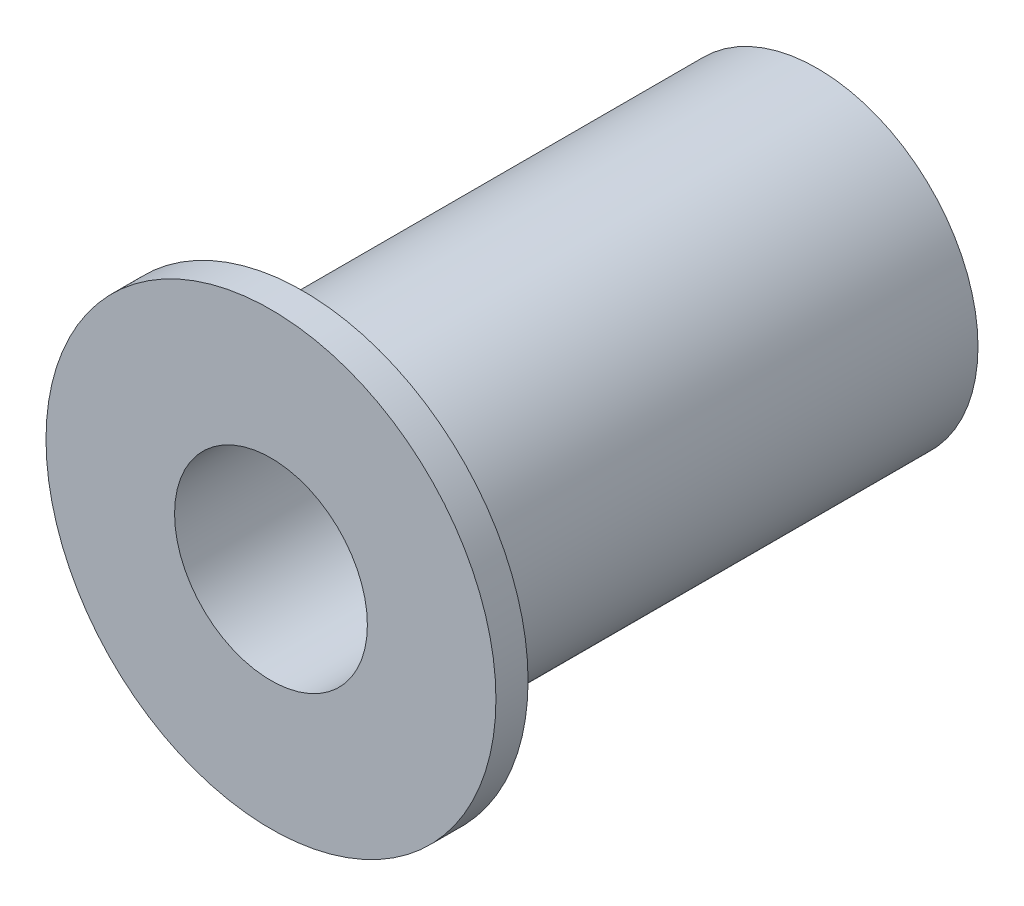
ISO-10303-21;
HEADER;
FILE_DESCRIPTION(('STEP AP214'),'2;1');
FILE_NAME('part.step','',(''),(''),'','','');
FILE_SCHEMA(('AUTOMOTIVE_DESIGN { 1 0 10303 214 1 1 1 1 }'));
ENDSEC;
DATA;
#1=APPLICATION_CONTEXT('core data for automotive mechanical design processes');
#2=APPLICATION_PROTOCOL_DEFINITION('international standard','automotive_design',2000,#1);
#3=PRODUCT_CONTEXT('',#1,'mechanical');
#4=PRODUCT('Part','Part','',(#3));
#5=PRODUCT_RELATED_PRODUCT_CATEGORY('part','',(#4));
#6=PRODUCT_DEFINITION_FORMATION('','',#4);
#7=PRODUCT_DEFINITION_CONTEXT('part definition',#1,'design');
#8=PRODUCT_DEFINITION('design','',#6,#7);
#9=PRODUCT_DEFINITION_SHAPE('','',#8);
#10=(LENGTH_UNIT() NAMED_UNIT(*) SI_UNIT(.MILLI.,.METRE.));
#11=(NAMED_UNIT(*) PLANE_ANGLE_UNIT() SI_UNIT($,.RADIAN.));
#12=(NAMED_UNIT(*) SI_UNIT($,.STERADIAN.) SOLID_ANGLE_UNIT());
#13=UNCERTAINTY_MEASURE_WITH_UNIT(LENGTH_MEASURE(1.E-05),#10,'distance_accuracy_value','');
#14=(GEOMETRIC_REPRESENTATION_CONTEXT(3) GLOBAL_UNCERTAINTY_ASSIGNED_CONTEXT((#13)) GLOBAL_UNIT_ASSIGNED_CONTEXT((#10,
#11,#12)) REPRESENTATION_CONTEXT('',''));
#15=CARTESIAN_POINT('',(0.,0.,0.));
#16=DIRECTION('',(0.,0.,1.));
#17=DIRECTION('',(1.,0.,0.));
#18=AXIS2_PLACEMENT_3D('',#15,#16,#17);
#19=CARTESIAN_POINT('',(0.,0.,0.));
#20=DIRECTION('',(0.,0.,1.));
#21=DIRECTION('',(1.,0.,0.));
#22=AXIS2_PLACEMENT_3D('',#19,#20,#21);
#23=PLANE('',#22);
#24=CARTESIAN_POINT('',(0.,0.,0.));
#25=DIRECTION('',(0.,0.,1.));
#26=DIRECTION('',(1.,0.,0.));
#27=AXIS2_PLACEMENT_3D('',#24,#25,#26);
#28=CIRCLE('',#27,7.9375);
#29=CARTESIAN_POINT('',(7.9375,0.,0.));
#30=VERTEX_POINT('',#29);
#31=EDGE_CURVE('E35',#30,#30,#28,.T.);
#32=ORIENTED_EDGE('',*,*,#31,.F.);
#33=EDGE_LOOP('',(#32));
#34=FACE_BOUND('',#33,.T.);
#35=CARTESIAN_POINT('',(0.,0.,0.));
#36=DIRECTION('',(0.,0.,1.));
#37=DIRECTION('',(1.,0.,0.));
#38=AXIS2_PLACEMENT_3D('',#35,#36,#37);
#39=CIRCLE('',#38,4.7625);
#40=CARTESIAN_POINT('',(4.7625,0.,0.));
#41=VERTEX_POINT('',#40);
#42=EDGE_CURVE('E42',#41,#41,#39,.T.);
#43=ORIENTED_EDGE('',*,*,#42,.T.);
#44=EDGE_LOOP('',(#43));
#45=FACE_BOUND('',#44,.T.);
#46=ADVANCED_FACE('F31',(#34,#45),#23,.F.);
#47=CARTESIAN_POINT('',(0.,0.,25.4));
#48=DIRECTION('',(0.,0.,-1.));
#49=DIRECTION('',(-1.,0.,0.));
#50=AXIS2_PLACEMENT_3D('',#47,#48,#49);
#51=CYLINDRICAL_SURFACE('',#50,7.9375);
#52=CARTESIAN_POINT('',(0.,0.,25.4));
#53=DIRECTION('',(0.,0.,1.));
#54=DIRECTION('',(1.,0.,0.));
#55=AXIS2_PLACEMENT_3D('',#52,#53,#54);
#56=CIRCLE('',#55,7.9375);
#57=CARTESIAN_POINT('',(7.9375,0.,25.4));
#58=VERTEX_POINT('',#57);
#59=EDGE_CURVE('E10',#58,#58,#56,.T.);
#60=ORIENTED_EDGE('',*,*,#59,.F.);
#61=EDGE_LOOP('',(#60));
#62=FACE_BOUND('',#61,.T.);
#63=ORIENTED_EDGE('',*,*,#31,.T.);
#64=EDGE_LOOP('',(#63));
#65=FACE_BOUND('',#64,.T.);
#66=ADVANCED_FACE('F33',(#62,#65),#51,.T.);
#67=CARTESIAN_POINT('',(0.,0.,25.4));
#68=DIRECTION('',(0.,0.,-1.));
#69=DIRECTION('',(-1.,0.,0.));
#70=AXIS2_PLACEMENT_3D('',#67,#68,#69);
#71=CYLINDRICAL_SURFACE('',#70,4.7625);
#72=ORIENTED_EDGE('',*,*,#42,.F.);
#73=EDGE_LOOP('',(#72));
#74=FACE_BOUND('',#73,.T.);
#75=CARTESIAN_POINT('',(0.,0.,26.9875));
#76=DIRECTION('',(0.,0.,1.));
#77=DIRECTION('',(1.,0.,0.));
#78=AXIS2_PLACEMENT_3D('',#75,#76,#77);
#79=CIRCLE('',#78,4.7625);
#80=CARTESIAN_POINT('',(4.7625,0.,26.9875));
#81=VERTEX_POINT('',#80);
#82=EDGE_CURVE('E50',#81,#81,#79,.T.);
#83=ORIENTED_EDGE('',*,*,#82,.T.);
#84=EDGE_LOOP('',(#83));
#85=FACE_BOUND('',#84,.T.);
#86=ADVANCED_FACE('F56',(#74,#85),#71,.F.);
#87=CARTESIAN_POINT('',(0.,0.,25.4));
#88=DIRECTION('',(0.,0.,1.));
#89=DIRECTION('',(1.,0.,0.));
#90=AXIS2_PLACEMENT_3D('',#87,#88,#89);
#91=PLANE('',#90);
#92=CARTESIAN_POINT('',(0.,0.,25.4));
#93=DIRECTION('',(0.,0.,1.));
#94=DIRECTION('',(1.,0.,0.));
#95=AXIS2_PLACEMENT_3D('',#92,#93,#94);
#96=CIRCLE('',#95,11.1125);
#97=CARTESIAN_POINT('',(11.1125,0.,25.4));
#98=VERTEX_POINT('',#97);
#99=EDGE_CURVE('E47',#98,#98,#96,.T.);
#100=ORIENTED_EDGE('',*,*,#99,.F.);
#101=EDGE_LOOP('',(#100));
#102=FACE_BOUND('',#101,.T.);
#103=ORIENTED_EDGE('',*,*,#59,.T.);
#104=EDGE_LOOP('',(#103));
#105=FACE_BOUND('',#104,.T.);
#106=ADVANCED_FACE('F61',(#102,#105),#91,.F.);
#107=CARTESIAN_POINT('',(0.,0.,26.9875));
#108=DIRECTION('',(0.,0.,1.));
#109=DIRECTION('',(1.,0.,0.));
#110=AXIS2_PLACEMENT_3D('',#107,#108,#109);
#111=PLANE('',#110);
#112=CARTESIAN_POINT('',(0.,0.,26.9875));
#113=DIRECTION('',(0.,0.,1.));
#114=DIRECTION('',(1.,0.,0.));
#115=AXIS2_PLACEMENT_3D('',#112,#113,#114);
#116=CIRCLE('',#115,11.1125);
#117=CARTESIAN_POINT('',(11.1125,0.,26.9875));
#118=VERTEX_POINT('',#117);
#119=EDGE_CURVE('E46',#118,#118,#116,.T.);
#120=ORIENTED_EDGE('',*,*,#119,.T.);
#121=EDGE_LOOP('',(#120));
#122=FACE_BOUND('',#121,.T.);
#123=ORIENTED_EDGE('',*,*,#82,.F.);
#124=EDGE_LOOP('',(#123));
#125=FACE_BOUND('',#124,.T.);
#126=ADVANCED_FACE('F58',(#122,#125),#111,.T.);
#127=CARTESIAN_POINT('',(0.,0.,26.9875));
#128=DIRECTION('',(0.,0.,-1.));
#129=DIRECTION('',(-1.,0.,0.));
#130=AXIS2_PLACEMENT_3D('',#127,#128,#129);
#131=CYLINDRICAL_SURFACE('',#130,11.1125);
#132=ORIENTED_EDGE('',*,*,#119,.F.);
#133=EDGE_LOOP('',(#132));
#134=FACE_BOUND('',#133,.T.);
#135=ORIENTED_EDGE('',*,*,#99,.T.);
#136=EDGE_LOOP('',(#135));
#137=FACE_BOUND('',#136,.T.);
#138=ADVANCED_FACE('F60',(#134,#137),#131,.T.);
#139=CLOSED_SHELL('',(#46,#66,#86,#106,#126,#138));
#140=MANIFOLD_SOLID_BREP('B2',#139);
#141=ADVANCED_BREP_SHAPE_REPRESENTATION('',(#18,#140),#14);
#142=SHAPE_DEFINITION_REPRESENTATION(#9,#141);
ENDSEC;
END-ISO-10303-21;
